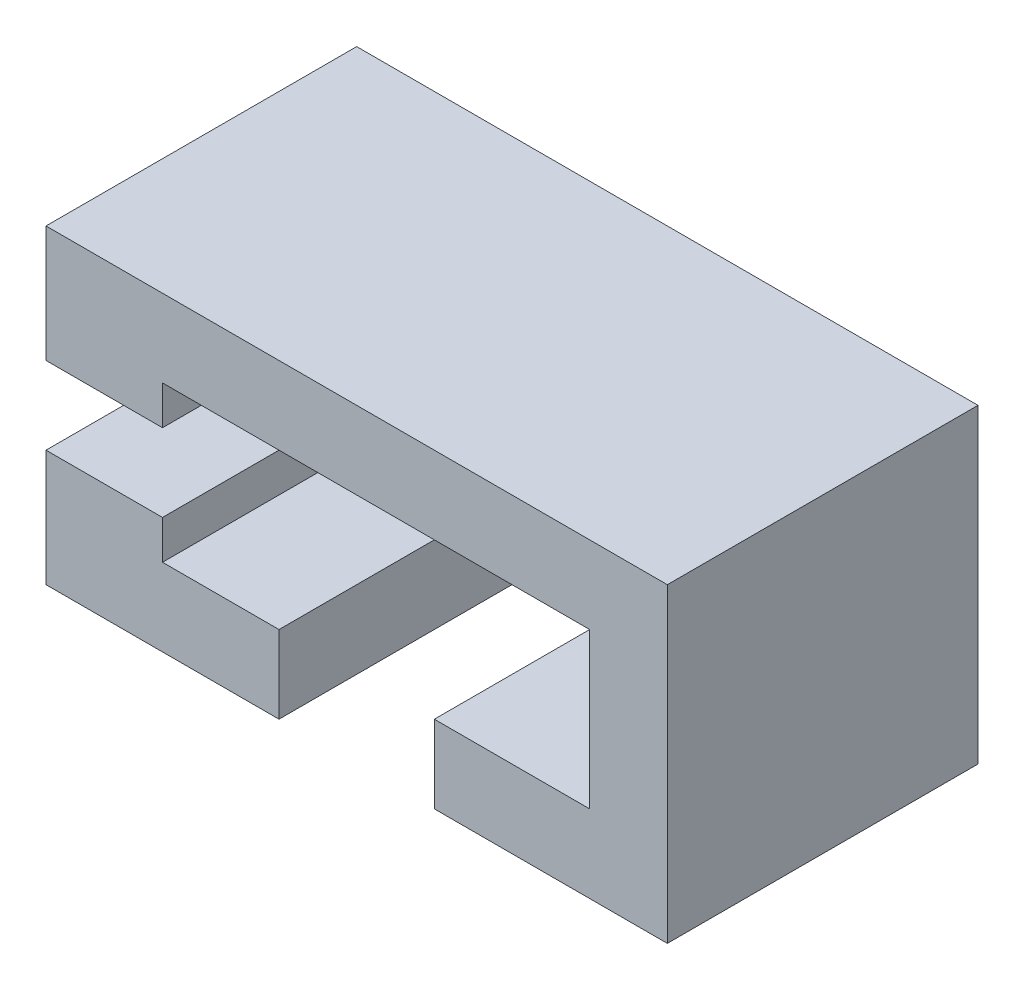
ISO-10303-21;
HEADER;
FILE_DESCRIPTION(('STEP AP214'),'2;1');
FILE_NAME('part.step','',(''),(''),'','','');
FILE_SCHEMA(('AUTOMOTIVE_DESIGN { 1 0 10303 214 1 1 1 1 }'));
ENDSEC;
DATA;
#1=APPLICATION_CONTEXT('core data for automotive mechanical design processes');
#2=APPLICATION_PROTOCOL_DEFINITION('international standard','automotive_design',2000,#1);
#3=PRODUCT_CONTEXT('',#1,'mechanical');
#4=PRODUCT('Part','Part','',(#3));
#5=PRODUCT_RELATED_PRODUCT_CATEGORY('part','',(#4));
#6=PRODUCT_DEFINITION_FORMATION('','',#4);
#7=PRODUCT_DEFINITION_CONTEXT('part definition',#1,'design');
#8=PRODUCT_DEFINITION('design','',#6,#7);
#9=PRODUCT_DEFINITION_SHAPE('','',#8);
#10=(LENGTH_UNIT() NAMED_UNIT(*) SI_UNIT(.MILLI.,.METRE.));
#11=(NAMED_UNIT(*) PLANE_ANGLE_UNIT() SI_UNIT($,.RADIAN.));
#12=(NAMED_UNIT(*) SI_UNIT($,.STERADIAN.) SOLID_ANGLE_UNIT());
#13=UNCERTAINTY_MEASURE_WITH_UNIT(LENGTH_MEASURE(1.E-05),#10,'distance_accuracy_value','');
#14=(GEOMETRIC_REPRESENTATION_CONTEXT(3) GLOBAL_UNCERTAINTY_ASSIGNED_CONTEXT((#13)) GLOBAL_UNIT_ASSIGNED_CONTEXT((#10,
#11,#12)) REPRESENTATION_CONTEXT('',''));
#15=CARTESIAN_POINT('',(0.,0.,0.));
#16=DIRECTION('',(0.,0.,1.));
#17=DIRECTION('',(1.,0.,0.));
#18=AXIS2_PLACEMENT_3D('',#15,#16,#17);
#19=CARTESIAN_POINT('',(-80.,10.,0.));
#20=DIRECTION('',(0.,-1.,0.));
#21=DIRECTION('',(0.,0.,-1.));
#22=AXIS2_PLACEMENT_3D('',#19,#20,#21);
#23=PLANE('',#22);
#24=DIRECTION('',(0.,0.,1.));
#25=VECTOR('',#24,1.);
#26=CARTESIAN_POINT('',(-65.,10.,-40.));
#27=LINE('',#26,#25);
#28=CARTESIAN_POINT('',(-65.,10.,-20.));
#29=VERTEX_POINT('',#28);
#30=CARTESIAN_POINT('',(-65.,10.,0.));
#31=VERTEX_POINT('',#30);
#32=EDGE_CURVE('E122',#29,#31,#27,.T.);
#33=ORIENTED_EDGE('',*,*,#32,.T.);
#34=DIRECTION('',(1.,0.,0.));
#35=VECTOR('',#34,1.);
#36=CARTESIAN_POINT('',(-80.,10.,0.));
#37=LINE('',#36,#35);
#38=CARTESIAN_POINT('',(-80.,10.,0.));
#39=VERTEX_POINT('',#38);
#40=EDGE_CURVE('E115',#39,#31,#37,.T.);
#41=ORIENTED_EDGE('',*,*,#40,.F.);
#42=DIRECTION('',(0.,0.,-1.));
#43=VECTOR('',#42,1.);
#44=CARTESIAN_POINT('',(-80.,10.,0.));
#45=LINE('',#44,#43);
#46=CARTESIAN_POINT('',(-80.,10.,-20.));
#47=VERTEX_POINT('',#46);
#48=EDGE_CURVE('E118',#39,#47,#45,.T.);
#49=ORIENTED_EDGE('',*,*,#48,.T.);
#50=DIRECTION('',(1.,0.,0.));
#51=VECTOR('',#50,1.);
#52=CARTESIAN_POINT('',(-80.,10.,-20.));
#53=LINE('',#52,#51);
#54=EDGE_CURVE('E127',#47,#29,#53,.T.);
#55=ORIENTED_EDGE('',*,*,#54,.T.);
#56=EDGE_LOOP('',(#33,#41,#49,#55));
#57=FACE_BOUND('',#56,.T.);
#58=ADVANCED_FACE('F39',(#57),#23,.T.);
#59=CARTESIAN_POINT('',(-80.,-15.,0.));
#60=DIRECTION('',(0.,-1.,0.));
#61=DIRECTION('',(0.,0.,-1.));
#62=AXIS2_PLACEMENT_3D('',#59,#60,#61);
#63=PLANE('',#62);
#64=DIRECTION('',(0.,0.,1.));
#65=VECTOR('',#64,1.);
#66=CARTESIAN_POINT('',(-30.,-15.,0.));
#67=LINE('',#66,#65);
#68=CARTESIAN_POINT('',(-30.,-15.,-40.));
#69=VERTEX_POINT('',#68);
#70=CARTESIAN_POINT('',(-30.,-15.,0.));
#71=VERTEX_POINT('',#70);
#72=EDGE_CURVE('E209',#69,#71,#67,.T.);
#73=ORIENTED_EDGE('',*,*,#72,.F.);
#74=DIRECTION('',(1.,0.,0.));
#75=VECTOR('',#74,1.);
#76=CARTESIAN_POINT('',(-80.,-15.,-40.));
#77=LINE('',#76,#75);
#78=CARTESIAN_POINT('',(0.,-15.,-40.));
#79=VERTEX_POINT('',#78);
#80=EDGE_CURVE('E179',#69,#79,#77,.T.);
#81=ORIENTED_EDGE('',*,*,#80,.T.);
#82=DIRECTION('',(0.,0.,-1.));
#83=VECTOR('',#82,1.);
#84=CARTESIAN_POINT('',(0.,-15.,0.));
#85=LINE('',#84,#83);
#86=CARTESIAN_POINT('',(0.,-15.,0.));
#87=VERTEX_POINT('',#86);
#88=EDGE_CURVE('E149',#87,#79,#85,.T.);
#89=ORIENTED_EDGE('',*,*,#88,.F.);
#90=DIRECTION('',(1.,0.,0.));
#91=VECTOR('',#90,1.);
#92=CARTESIAN_POINT('',(-80.,-15.,0.));
#93=LINE('',#92,#91);
#94=EDGE_CURVE('E184',#71,#87,#93,.T.);
#95=ORIENTED_EDGE('',*,*,#94,.F.);
#96=EDGE_LOOP('',(#73,#81,#89,#95));
#97=FACE_BOUND('',#96,.T.);
#98=ADVANCED_FACE('F245',(#97),#63,.T.);
#99=CARTESIAN_POINT('',(-80.,0.,-20.));
#100=DIRECTION('',(0.,1.,0.));
#101=DIRECTION('',(0.,0.,1.));
#102=AXIS2_PLACEMENT_3D('',#99,#100,#101);
#103=PLANE('',#102);
#104=DIRECTION('',(0.,0.,-1.));
#105=VECTOR('',#104,1.);
#106=CARTESIAN_POINT('',(-65.,0.,0.));
#107=LINE('',#106,#105);
#108=CARTESIAN_POINT('',(-65.,0.,0.));
#109=VERTEX_POINT('',#108);
#110=CARTESIAN_POINT('',(-65.,0.,-20.));
#111=VERTEX_POINT('',#110);
#112=EDGE_CURVE('E321',#109,#111,#107,.T.);
#113=ORIENTED_EDGE('',*,*,#112,.T.);
#114=DIRECTION('',(1.,0.,0.));
#115=VECTOR('',#114,1.);
#116=CARTESIAN_POINT('',(-80.,0.,-20.));
#117=LINE('',#116,#115);
#118=CARTESIAN_POINT('',(-80.,0.,-20.));
#119=VERTEX_POINT('',#118);
#120=EDGE_CURVE('E64',#119,#111,#117,.T.);
#121=ORIENTED_EDGE('',*,*,#120,.F.);
#122=DIRECTION('',(0.,0.,1.));
#123=VECTOR('',#122,1.);
#124=CARTESIAN_POINT('',(-80.,0.,-20.));
#125=LINE('',#124,#123);
#126=CARTESIAN_POINT('',(-80.,0.,0.));
#127=VERTEX_POINT('',#126);
#128=EDGE_CURVE('E165',#119,#127,#125,.T.);
#129=ORIENTED_EDGE('',*,*,#128,.T.);
#130=DIRECTION('',(1.,0.,0.));
#131=VECTOR('',#130,1.);
#132=CARTESIAN_POINT('',(-80.,0.,0.));
#133=LINE('',#132,#131);
#134=EDGE_CURVE('E96',#127,#109,#133,.T.);
#135=ORIENTED_EDGE('',*,*,#134,.T.);
#136=EDGE_LOOP('',(#113,#121,#129,#135));
#137=FACE_BOUND('',#136,.T.);
#138=ADVANCED_FACE('F41',(#137),#103,.T.);
#139=CARTESIAN_POINT('',(-80.,10.,-20.));
#140=DIRECTION('',(0.,0.,1.));
#141=DIRECTION('',(1.,0.,0.));
#142=AXIS2_PLACEMENT_3D('',#139,#140,#141);
#143=PLANE('',#142);
#144=DIRECTION('',(0.,-1.,0.));
#145=VECTOR('',#144,1.);
#146=CARTESIAN_POINT('',(-65.,10.,-20.));
#147=LINE('',#146,#145);
#148=EDGE_CURVE('E324',#29,#111,#147,.T.);
#149=ORIENTED_EDGE('',*,*,#148,.F.);
#150=ORIENTED_EDGE('',*,*,#54,.F.);
#151=DIRECTION('',(0.,-1.,0.));
#152=VECTOR('',#151,1.);
#153=CARTESIAN_POINT('',(-80.,10.,-20.));
#154=LINE('',#153,#152);
#155=EDGE_CURVE('E135',#47,#119,#154,.T.);
#156=ORIENTED_EDGE('',*,*,#155,.T.);
#157=ORIENTED_EDGE('',*,*,#120,.T.);
#158=EDGE_LOOP('',(#149,#150,#156,#157));
#159=FACE_BOUND('',#158,.T.);
#160=ADVANCED_FACE('F253',(#159),#143,.T.);
#161=CARTESIAN_POINT('',(-80.,25.,0.));
#162=DIRECTION('',(0.,0.,1.));
#163=DIRECTION('',(0.,-1.,0.));
#164=AXIS2_PLACEMENT_3D('',#161,#162,#163);
#165=PLANE('',#164);
#166=DIRECTION('',(0.,-1.,0.));
#167=VECTOR('',#166,1.);
#168=CARTESIAN_POINT('',(-65.,10.,0.));
#169=LINE('',#168,#167);
#170=CARTESIAN_POINT('',(-65.,15.,0.));
#171=VERTEX_POINT('',#170);
#172=EDGE_CURVE('E351',#171,#31,#169,.T.);
#173=ORIENTED_EDGE('',*,*,#172,.F.);
#174=DIRECTION('',(-1.,0.,0.));
#175=VECTOR('',#174,1.);
#176=CARTESIAN_POINT('',(-65.,15.,0.));
#177=LINE('',#176,#175);
#178=CARTESIAN_POINT('',(-9.99999999999995,15.,0.));
#179=VERTEX_POINT('',#178);
#180=EDGE_CURVE('E362',#179,#171,#177,.T.);
#181=ORIENTED_EDGE('',*,*,#180,.F.);
#182=DIRECTION('',(0.,1.,0.));
#183=VECTOR('',#182,1.);
#184=CARTESIAN_POINT('',(-9.99999999999995,15.,0.));
#185=LINE('',#184,#183);
#186=CARTESIAN_POINT('',(-10.,-5.,0.));
#187=VERTEX_POINT('',#186);
#188=EDGE_CURVE('E343',#187,#179,#185,.T.);
#189=ORIENTED_EDGE('',*,*,#188,.F.);
#190=DIRECTION('',(1.,0.,0.));
#191=VECTOR('',#190,1.);
#192=CARTESIAN_POINT('',(-30.,-5.,0.));
#193=LINE('',#192,#191);
#194=CARTESIAN_POINT('',(-30.,-5.,0.));
#195=VERTEX_POINT('',#194);
#196=EDGE_CURVE('E332',#195,#187,#193,.T.);
#197=ORIENTED_EDGE('',*,*,#196,.F.);
#198=DIRECTION('',(0.,1.,0.));
#199=VECTOR('',#198,1.);
#200=CARTESIAN_POINT('',(-30.,0.,0.));
#201=LINE('',#200,#199);
#202=EDGE_CURVE('E11',#71,#195,#201,.T.);
#203=ORIENTED_EDGE('',*,*,#202,.F.);
#204=ORIENTED_EDGE('',*,*,#94,.T.);
#205=DIRECTION('',(0.,-1.,0.));
#206=VECTOR('',#205,1.);
#207=CARTESIAN_POINT('',(0.,25.,0.));
#208=LINE('',#207,#206);
#209=CARTESIAN_POINT('',(0.,25.,0.));
#210=VERTEX_POINT('',#209);
#211=EDGE_CURVE('E162',#210,#87,#208,.T.);
#212=ORIENTED_EDGE('',*,*,#211,.F.);
#213=DIRECTION('',(1.,0.,0.));
#214=VECTOR('',#213,1.);
#215=CARTESIAN_POINT('',(-80.,25.,0.));
#216=LINE('',#215,#214);
#217=CARTESIAN_POINT('',(-80.,25.,0.));
#218=VERTEX_POINT('',#217);
#219=EDGE_CURVE('E87',#218,#210,#216,.T.);
#220=ORIENTED_EDGE('',*,*,#219,.F.);
#221=DIRECTION('',(0.,-1.,0.));
#222=VECTOR('',#221,1.);
#223=CARTESIAN_POINT('',(-80.,25.,0.));
#224=LINE('',#223,#222);
#225=EDGE_CURVE('E133',#218,#39,#224,.T.);
#226=ORIENTED_EDGE('',*,*,#225,.T.);
#227=ORIENTED_EDGE('',*,*,#40,.T.);
#228=EDGE_LOOP('',(#173,#181,#189,#197,#203,#204,#212,#220,#226,#227));
#229=FACE_BOUND('',#228,.T.);
#230=ADVANCED_FACE('F138',(#229),#165,.T.);
#231=CARTESIAN_POINT('',(-80.,25.,-40.));
#232=DIRECTION('',(0.,1.,0.));
#233=DIRECTION('',(0.,0.,1.));
#234=AXIS2_PLACEMENT_3D('',#231,#232,#233);
#235=PLANE('',#234);
#236=DIRECTION('',(0.,0.,1.));
#237=VECTOR('',#236,1.);
#238=CARTESIAN_POINT('',(0.,25.,-40.));
#239=LINE('',#238,#237);
#240=CARTESIAN_POINT('',(0.,25.,-40.));
#241=VERTEX_POINT('',#240);
#242=EDGE_CURVE('E158',#241,#210,#239,.T.);
#243=ORIENTED_EDGE('',*,*,#242,.F.);
#244=DIRECTION('',(1.,0.,0.));
#245=VECTOR('',#244,1.);
#246=CARTESIAN_POINT('',(-80.,25.,-40.));
#247=LINE('',#246,#245);
#248=CARTESIAN_POINT('',(-80.,25.,-40.));
#249=VERTEX_POINT('',#248);
#250=EDGE_CURVE('E172',#249,#241,#247,.T.);
#251=ORIENTED_EDGE('',*,*,#250,.F.);
#252=DIRECTION('',(0.,0.,1.));
#253=VECTOR('',#252,1.);
#254=CARTESIAN_POINT('',(-80.,25.,-40.));
#255=LINE('',#254,#253);
#256=EDGE_CURVE('E140',#249,#218,#255,.T.);
#257=ORIENTED_EDGE('',*,*,#256,.T.);
#258=ORIENTED_EDGE('',*,*,#219,.T.);
#259=EDGE_LOOP('',(#243,#251,#257,#258));
#260=FACE_BOUND('',#259,.T.);
#261=ADVANCED_FACE('F229',(#260),#235,.T.);
#262=CARTESIAN_POINT('',(-80.,-15.,-40.));
#263=DIRECTION('',(0.,0.,-1.));
#264=DIRECTION('',(-1.,0.,0.));
#265=AXIS2_PLACEMENT_3D('',#262,#263,#264);
#266=PLANE('',#265);
#267=DIRECTION('',(0.,-1.,0.));
#268=VECTOR('',#267,1.);
#269=CARTESIAN_POINT('',(-65.,10.,-40.));
#270=LINE('',#269,#268);
#271=CARTESIAN_POINT('',(-65.,15.,-40.));
#272=VERTEX_POINT('',#271);
#273=CARTESIAN_POINT('',(-65.,-5.,-40.));
#274=VERTEX_POINT('',#273);
#275=EDGE_CURVE('E355',#272,#274,#270,.T.);
#276=ORIENTED_EDGE('',*,*,#275,.T.);
#277=DIRECTION('',(-1.,0.,0.));
#278=VECTOR('',#277,1.);
#279=CARTESIAN_POINT('',(-50.,-5.,-40.));
#280=LINE('',#279,#278);
#281=CARTESIAN_POINT('',(-50.,-5.,-40.));
#282=VERTEX_POINT('',#281);
#283=EDGE_CURVE('E305',#282,#274,#280,.T.);
#284=ORIENTED_EDGE('',*,*,#283,.F.);
#285=DIRECTION('',(0.,-1.,0.));
#286=VECTOR('',#285,1.);
#287=CARTESIAN_POINT('',(-50.,10.,-40.));
#288=LINE('',#287,#286);
#289=CARTESIAN_POINT('',(-50.,-15.,-40.));
#290=VERTEX_POINT('',#289);
#291=EDGE_CURVE('E380',#282,#290,#288,.T.);
#292=ORIENTED_EDGE('',*,*,#291,.T.);
#293=CARTESIAN_POINT('',(-80.,-15.,-40.));
#294=VERTEX_POINT('',#293);
#295=EDGE_CURVE('E175',#294,#290,#77,.T.);
#296=ORIENTED_EDGE('',*,*,#295,.F.);
#297=DIRECTION('',(0.,1.,0.));
#298=VECTOR('',#297,1.);
#299=CARTESIAN_POINT('',(-80.,-15.,-40.));
#300=LINE('',#299,#298);
#301=EDGE_CURVE('E143',#294,#249,#300,.T.);
#302=ORIENTED_EDGE('',*,*,#301,.T.);
#303=ORIENTED_EDGE('',*,*,#250,.T.);
#304=DIRECTION('',(0.,1.,0.));
#305=VECTOR('',#304,1.);
#306=CARTESIAN_POINT('',(0.,-15.,-40.));
#307=LINE('',#306,#305);
#308=EDGE_CURVE('E153',#79,#241,#307,.T.);
#309=ORIENTED_EDGE('',*,*,#308,.F.);
#310=ORIENTED_EDGE('',*,*,#80,.F.);
#311=DIRECTION('',(0.,-1.,0.));
#312=VECTOR('',#311,1.);
#313=CARTESIAN_POINT('',(-30.,10.,-40.));
#314=LINE('',#313,#312);
#315=CARTESIAN_POINT('',(-30.,-5.,-40.));
#316=VERTEX_POINT('',#315);
#317=EDGE_CURVE('E154',#316,#69,#314,.T.);
#318=ORIENTED_EDGE('',*,*,#317,.F.);
#319=DIRECTION('',(1.,0.,0.));
#320=VECTOR('',#319,1.);
#321=CARTESIAN_POINT('',(-30.,-5.,-40.));
#322=LINE('',#321,#320);
#323=CARTESIAN_POINT('',(-10.,-5.,-40.));
#324=VERTEX_POINT('',#323);
#325=EDGE_CURVE('E55',#316,#324,#322,.T.);
#326=ORIENTED_EDGE('',*,*,#325,.T.);
#327=DIRECTION('',(0.,1.,0.));
#328=VECTOR('',#327,1.);
#329=CARTESIAN_POINT('',(-9.99999999999995,15.,-40.));
#330=LINE('',#329,#328);
#331=CARTESIAN_POINT('',(-9.99999999999995,15.,-40.));
#332=VERTEX_POINT('',#331);
#333=EDGE_CURVE('E346',#324,#332,#330,.T.);
#334=ORIENTED_EDGE('',*,*,#333,.T.);
#335=DIRECTION('',(-1.,0.,0.));
#336=VECTOR('',#335,1.);
#337=CARTESIAN_POINT('',(-65.,15.,-40.));
#338=LINE('',#337,#336);
#339=EDGE_CURVE('E350',#332,#272,#338,.T.);
#340=ORIENTED_EDGE('',*,*,#339,.T.);
#341=EDGE_LOOP('',(#276,#284,#292,#296,#302,#303,#309,#310,#318,#326,#334,#340));
#342=FACE_BOUND('',#341,.T.);
#343=ADVANCED_FACE('F226',(#342),#266,.T.);
#344=DIRECTION('',(0.,0.,-1.));
#345=VECTOR('',#344,1.);
#346=CARTESIAN_POINT('',(-50.,-15.,-40.));
#347=LINE('',#346,#345);
#348=CARTESIAN_POINT('',(-50.,-15.,0.));
#349=VERTEX_POINT('',#348);
#350=EDGE_CURVE('E197',#349,#290,#347,.T.);
#351=ORIENTED_EDGE('',*,*,#350,.F.);
#352=CARTESIAN_POINT('',(-80.,-15.,0.));
#353=VERTEX_POINT('',#352);
#354=EDGE_CURVE('E180',#353,#349,#93,.T.);
#355=ORIENTED_EDGE('',*,*,#354,.F.);
#356=DIRECTION('',(0.,0.,-1.));
#357=VECTOR('',#356,1.);
#358=CARTESIAN_POINT('',(-80.,-15.,0.));
#359=LINE('',#358,#357);
#360=EDGE_CURVE('E214',#353,#294,#359,.T.);
#361=ORIENTED_EDGE('',*,*,#360,.T.);
#362=ORIENTED_EDGE('',*,*,#295,.T.);
#363=EDGE_LOOP('',(#351,#355,#361,#362));
#364=FACE_BOUND('',#363,.T.);
#365=ADVANCED_FACE('F205',(#364),#63,.T.);
#366=CARTESIAN_POINT('',(-80.,0.,0.));
#367=DIRECTION('',(0.,0.,1.));
#368=DIRECTION('',(0.,-1.,0.));
#369=AXIS2_PLACEMENT_3D('',#366,#367,#368);
#370=PLANE('',#369);
#371=DIRECTION('',(0.,1.,0.));
#372=VECTOR('',#371,1.);
#373=CARTESIAN_POINT('',(-65.,-5.,0.));
#374=LINE('',#373,#372);
#375=CARTESIAN_POINT('',(-65.,-5.,0.));
#376=VERTEX_POINT('',#375);
#377=EDGE_CURVE('E317',#376,#109,#374,.T.);
#378=ORIENTED_EDGE('',*,*,#377,.T.);
#379=ORIENTED_EDGE('',*,*,#134,.F.);
#380=DIRECTION('',(0.,-1.,0.));
#381=VECTOR('',#380,1.);
#382=CARTESIAN_POINT('',(-80.,0.,0.));
#383=LINE('',#382,#381);
#384=EDGE_CURVE('E212',#127,#353,#383,.T.);
#385=ORIENTED_EDGE('',*,*,#384,.T.);
#386=ORIENTED_EDGE('',*,*,#354,.T.);
#387=DIRECTION('',(0.,-1.,0.));
#388=VECTOR('',#387,1.);
#389=CARTESIAN_POINT('',(-50.,0.,0.));
#390=LINE('',#389,#388);
#391=CARTESIAN_POINT('',(-50.,-5.,0.));
#392=VERTEX_POINT('',#391);
#393=EDGE_CURVE('E48',#392,#349,#390,.T.);
#394=ORIENTED_EDGE('',*,*,#393,.F.);
#395=DIRECTION('',(-1.,0.,0.));
#396=VECTOR('',#395,1.);
#397=CARTESIAN_POINT('',(-50.,-5.,0.));
#398=LINE('',#397,#396);
#399=EDGE_CURVE('E314',#392,#376,#398,.T.);
#400=ORIENTED_EDGE('',*,*,#399,.T.);
#401=EDGE_LOOP('',(#378,#379,#385,#386,#394,#400));
#402=FACE_BOUND('',#401,.T.);
#403=ADVANCED_FACE('F211',(#402),#370,.T.);
#404=CARTESIAN_POINT('',(-80.,0.,0.));
#405=DIRECTION('',(1.,0.,0.));
#406=DIRECTION('',(0.,0.,-1.));
#407=AXIS2_PLACEMENT_3D('',#404,#405,#406);
#408=PLANE('',#407);
#409=ORIENTED_EDGE('',*,*,#128,.F.);
#410=ORIENTED_EDGE('',*,*,#155,.F.);
#411=ORIENTED_EDGE('',*,*,#48,.F.);
#412=ORIENTED_EDGE('',*,*,#225,.F.);
#413=ORIENTED_EDGE('',*,*,#256,.F.);
#414=ORIENTED_EDGE('',*,*,#301,.F.);
#415=ORIENTED_EDGE('',*,*,#360,.F.);
#416=ORIENTED_EDGE('',*,*,#384,.F.);
#417=EDGE_LOOP('',(#409,#410,#411,#412,#413,#414,#415,#416));
#418=FACE_BOUND('',#417,.T.);
#419=ADVANCED_FACE('F131',(#418),#408,.F.);
#420=CARTESIAN_POINT('',(0.,0.,0.));
#421=DIRECTION('',(1.,0.,0.));
#422=DIRECTION('',(0.,0.,-1.));
#423=AXIS2_PLACEMENT_3D('',#420,#421,#422);
#424=PLANE('',#423);
#425=ORIENTED_EDGE('',*,*,#211,.T.);
#426=ORIENTED_EDGE('',*,*,#88,.T.);
#427=ORIENTED_EDGE('',*,*,#308,.T.);
#428=ORIENTED_EDGE('',*,*,#242,.T.);
#429=EDGE_LOOP('',(#425,#426,#427,#428));
#430=FACE_BOUND('',#429,.T.);
#431=ADVANCED_FACE('F231',(#430),#424,.T.);
#432=CARTESIAN_POINT('',(-30.,10.,0.));
#433=DIRECTION('',(1.,0.,0.));
#434=DIRECTION('',(0.,0.,-1.));
#435=AXIS2_PLACEMENT_3D('',#432,#433,#434);
#436=PLANE('',#435);
#437=ORIENTED_EDGE('',*,*,#202,.T.);
#438=DIRECTION('',(0.,0.,1.));
#439=VECTOR('',#438,1.);
#440=CARTESIAN_POINT('',(-30.,-5.,-40.));
#441=LINE('',#440,#439);
#442=EDGE_CURVE('E335',#316,#195,#441,.T.);
#443=ORIENTED_EDGE('',*,*,#442,.F.);
#444=ORIENTED_EDGE('',*,*,#317,.T.);
#445=ORIENTED_EDGE('',*,*,#72,.T.);
#446=EDGE_LOOP('',(#437,#443,#444,#445));
#447=FACE_BOUND('',#446,.T.);
#448=ADVANCED_FACE('F273',(#447),#436,.F.);
#449=CARTESIAN_POINT('',(-50.,10.,-40.));
#450=DIRECTION('',(-1.,0.,0.));
#451=DIRECTION('',(0.,0.,1.));
#452=AXIS2_PLACEMENT_3D('',#449,#450,#451);
#453=PLANE('',#452);
#454=ORIENTED_EDGE('',*,*,#291,.F.);
#455=DIRECTION('',(0.,0.,-1.));
#456=VECTOR('',#455,1.);
#457=CARTESIAN_POINT('',(-50.,-5.,0.));
#458=LINE('',#457,#456);
#459=EDGE_CURVE('E200',#392,#282,#458,.T.);
#460=ORIENTED_EDGE('',*,*,#459,.F.);
#461=ORIENTED_EDGE('',*,*,#393,.T.);
#462=ORIENTED_EDGE('',*,*,#350,.T.);
#463=EDGE_LOOP('',(#454,#460,#461,#462));
#464=FACE_BOUND('',#463,.T.);
#465=ADVANCED_FACE('F195',(#464),#453,.F.);
#466=CARTESIAN_POINT('',(-65.,10.,-40.));
#467=DIRECTION('',(-1.,0.,0.));
#468=DIRECTION('',(0.,0.,1.));
#469=AXIS2_PLACEMENT_3D('',#466,#467,#468);
#470=PLANE('',#469);
#471=ORIENTED_EDGE('',*,*,#172,.T.);
#472=ORIENTED_EDGE('',*,*,#32,.F.);
#473=ORIENTED_EDGE('',*,*,#148,.T.);
#474=ORIENTED_EDGE('',*,*,#112,.F.);
#475=ORIENTED_EDGE('',*,*,#377,.F.);
#476=DIRECTION('',(0.,0.,-1.));
#477=VECTOR('',#476,1.);
#478=CARTESIAN_POINT('',(-65.,-5.,0.));
#479=LINE('',#478,#477);
#480=EDGE_CURVE('E309',#376,#274,#479,.T.);
#481=ORIENTED_EDGE('',*,*,#480,.T.);
#482=ORIENTED_EDGE('',*,*,#275,.F.);
#483=DIRECTION('',(0.,0.,1.));
#484=VECTOR('',#483,1.);
#485=CARTESIAN_POINT('',(-65.,15.,-40.));
#486=LINE('',#485,#484);
#487=EDGE_CURVE('E371',#272,#171,#486,.T.);
#488=ORIENTED_EDGE('',*,*,#487,.T.);
#489=EDGE_LOOP('',(#471,#472,#473,#474,#475,#481,#482,#488));
#490=FACE_BOUND('',#489,.T.);
#491=ADVANCED_FACE('F278',(#490),#470,.F.);
#492=CARTESIAN_POINT('',(-65.,15.,-40.));
#493=DIRECTION('',(0.,1.,0.));
#494=DIRECTION('',(0.,0.,1.));
#495=AXIS2_PLACEMENT_3D('',#492,#493,#494);
#496=PLANE('',#495);
#497=ORIENTED_EDGE('',*,*,#180,.T.);
#498=ORIENTED_EDGE('',*,*,#487,.F.);
#499=ORIENTED_EDGE('',*,*,#339,.F.);
#500=DIRECTION('',(0.,0.,1.));
#501=VECTOR('',#500,1.);
#502=CARTESIAN_POINT('',(-9.99999999999995,15.,-40.));
#503=LINE('',#502,#501);
#504=EDGE_CURVE('E358',#332,#179,#503,.T.);
#505=ORIENTED_EDGE('',*,*,#504,.T.);
#506=EDGE_LOOP('',(#497,#498,#499,#505));
#507=FACE_BOUND('',#506,.T.);
#508=ADVANCED_FACE('F286',(#507),#496,.F.);
#509=CARTESIAN_POINT('',(-9.99999999999995,15.,-40.));
#510=DIRECTION('',(1.,0.,0.));
#511=DIRECTION('',(0.,0.,-1.));
#512=AXIS2_PLACEMENT_3D('',#509,#510,#511);
#513=PLANE('',#512);
#514=DIRECTION('',(0.,0.,1.));
#515=VECTOR('',#514,1.);
#516=CARTESIAN_POINT('',(-10.,-5.,-40.));
#517=LINE('',#516,#515);
#518=EDGE_CURVE('E339',#324,#187,#517,.T.);
#519=ORIENTED_EDGE('',*,*,#518,.T.);
#520=ORIENTED_EDGE('',*,*,#188,.T.);
#521=ORIENTED_EDGE('',*,*,#504,.F.);
#522=ORIENTED_EDGE('',*,*,#333,.F.);
#523=EDGE_LOOP('',(#519,#520,#521,#522));
#524=FACE_BOUND('',#523,.T.);
#525=ADVANCED_FACE('F282',(#524),#513,.F.);
#526=CARTESIAN_POINT('',(-30.,-5.,-40.));
#527=DIRECTION('',(0.,-1.,0.));
#528=DIRECTION('',(1.,0.,0.));
#529=AXIS2_PLACEMENT_3D('',#526,#527,#528);
#530=PLANE('',#529);
#531=ORIENTED_EDGE('',*,*,#196,.T.);
#532=ORIENTED_EDGE('',*,*,#518,.F.);
#533=ORIENTED_EDGE('',*,*,#325,.F.);
#534=ORIENTED_EDGE('',*,*,#442,.T.);
#535=EDGE_LOOP('',(#531,#532,#533,#534));
#536=FACE_BOUND('',#535,.T.);
#537=ADVANCED_FACE('F285',(#536),#530,.F.);
#538=CARTESIAN_POINT('',(-50.,-5.,0.));
#539=DIRECTION('',(0.,-1.,0.));
#540=DIRECTION('',(0.,0.,-1.));
#541=AXIS2_PLACEMENT_3D('',#538,#539,#540);
#542=PLANE('',#541);
#543=ORIENTED_EDGE('',*,*,#283,.T.);
#544=ORIENTED_EDGE('',*,*,#480,.F.);
#545=ORIENTED_EDGE('',*,*,#399,.F.);
#546=ORIENTED_EDGE('',*,*,#459,.T.);
#547=EDGE_LOOP('',(#543,#544,#545,#546));
#548=FACE_BOUND('',#547,.T.);
#549=ADVANCED_FACE('F296',(#548),#542,.F.);
#550=CLOSED_SHELL('',(#58,#98,#138,#160,#230,#261,#343,#365,#403,#419,#431,#448,#465,#491,#508,
#525,#537,#549));
#551=MANIFOLD_SOLID_BREP('B2',#550);
#552=ADVANCED_BREP_SHAPE_REPRESENTATION('',(#18,#551),#14);
#553=SHAPE_DEFINITION_REPRESENTATION(#9,#552);
ENDSEC;
END-ISO-10303-21;
